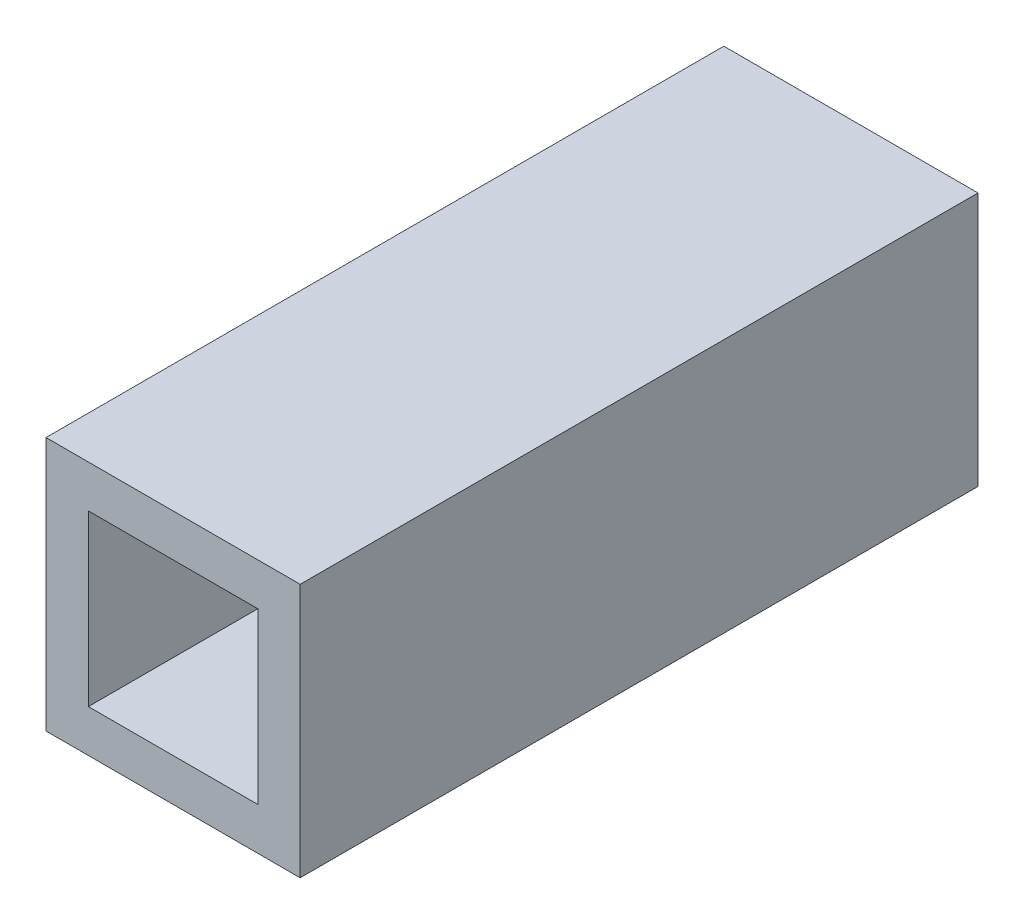
ISO-10303-21;
HEADER;
FILE_DESCRIPTION(('STEP AP214'),'2;1');
FILE_NAME('part.step','',(''),(''),'','','');
FILE_SCHEMA(('AUTOMOTIVE_DESIGN { 1 0 10303 214 1 1 1 1 }'));
ENDSEC;
DATA;
#1=APPLICATION_CONTEXT('core data for automotive mechanical design processes');
#2=APPLICATION_PROTOCOL_DEFINITION('international standard','automotive_design',2000,#1);
#3=PRODUCT_CONTEXT('',#1,'mechanical');
#4=PRODUCT('Part','Part','',(#3));
#5=PRODUCT_RELATED_PRODUCT_CATEGORY('part','',(#4));
#6=PRODUCT_DEFINITION_FORMATION('','',#4);
#7=PRODUCT_DEFINITION_CONTEXT('part definition',#1,'design');
#8=PRODUCT_DEFINITION('design','',#6,#7);
#9=PRODUCT_DEFINITION_SHAPE('','',#8);
#10=(LENGTH_UNIT() NAMED_UNIT(*) SI_UNIT(.MILLI.,.METRE.));
#11=(NAMED_UNIT(*) PLANE_ANGLE_UNIT() SI_UNIT($,.RADIAN.));
#12=(NAMED_UNIT(*) SI_UNIT($,.STERADIAN.) SOLID_ANGLE_UNIT());
#13=UNCERTAINTY_MEASURE_WITH_UNIT(LENGTH_MEASURE(1.E-05),#10,'distance_accuracy_value','');
#14=(GEOMETRIC_REPRESENTATION_CONTEXT(3) GLOBAL_UNCERTAINTY_ASSIGNED_CONTEXT((#13)) GLOBAL_UNIT_ASSIGNED_CONTEXT((#10,
#11,#12)) REPRESENTATION_CONTEXT('',''));
#15=CARTESIAN_POINT('',(0.,0.,0.));
#16=DIRECTION('',(0.,0.,1.));
#17=DIRECTION('',(1.,0.,0.));
#18=AXIS2_PLACEMENT_3D('',#15,#16,#17);
#19=CARTESIAN_POINT('',(9.52500000000001,-9.52499999999999,-50.8));
#20=DIRECTION('',(1.,0.,0.));
#21=DIRECTION('',(0.,0.,-1.));
#22=AXIS2_PLACEMENT_3D('',#19,#20,#21);
#23=PLANE('',#22);
#24=DIRECTION('',(0.,1.,0.));
#25=VECTOR('',#24,1.);
#26=CARTESIAN_POINT('',(9.52500000000001,-9.52499999999999,0.));
#27=LINE('',#26,#25);
#28=CARTESIAN_POINT('',(9.52500000000001,-9.52499999999999,0.));
#29=VERTEX_POINT('',#28);
#30=CARTESIAN_POINT('',(9.52500000000001,9.52500000000001,0.));
#31=VERTEX_POINT('',#30);
#32=EDGE_CURVE('E112',#29,#31,#27,.T.);
#33=ORIENTED_EDGE('',*,*,#32,.F.);
#34=DIRECTION('',(0.,0.,1.));
#35=VECTOR('',#34,1.);
#36=CARTESIAN_POINT('',(9.52500000000001,-9.52499999999999,-50.8));
#37=LINE('',#36,#35);
#38=CARTESIAN_POINT('',(9.52500000000001,-9.52499999999999,-50.8));
#39=VERTEX_POINT('',#38);
#40=EDGE_CURVE('E11',#39,#29,#37,.T.);
#41=ORIENTED_EDGE('',*,*,#40,.F.);
#42=DIRECTION('',(0.,1.,0.));
#43=VECTOR('',#42,1.);
#44=CARTESIAN_POINT('',(9.52500000000001,-9.52499999999999,-50.8));
#45=LINE('',#44,#43);
#46=CARTESIAN_POINT('',(9.52500000000001,9.52500000000001,-50.8));
#47=VERTEX_POINT('',#46);
#48=EDGE_CURVE('E151',#39,#47,#45,.T.);
#49=ORIENTED_EDGE('',*,*,#48,.T.);
#50=DIRECTION('',(0.,0.,1.));
#51=VECTOR('',#50,1.);
#52=CARTESIAN_POINT('',(9.52500000000001,9.52500000000001,-50.8));
#53=LINE('',#52,#51);
#54=EDGE_CURVE('E42',#47,#31,#53,.T.);
#55=ORIENTED_EDGE('',*,*,#54,.T.);
#56=EDGE_LOOP('',(#33,#41,#49,#55));
#57=FACE_BOUND('',#56,.T.);
#58=ADVANCED_FACE('F39',(#57),#23,.T.);
#59=CARTESIAN_POINT('',(-9.525,-9.52499999999999,-50.8));
#60=DIRECTION('',(0.,-1.,0.));
#61=DIRECTION('',(0.,0.,-1.));
#62=AXIS2_PLACEMENT_3D('',#59,#60,#61);
#63=PLANE('',#62);
#64=DIRECTION('',(1.,0.,0.));
#65=VECTOR('',#64,1.);
#66=CARTESIAN_POINT('',(-9.525,-9.52499999999999,0.));
#67=LINE('',#66,#65);
#68=CARTESIAN_POINT('',(-9.525,-9.52499999999999,0.));
#69=VERTEX_POINT('',#68);
#70=EDGE_CURVE('E156',#69,#29,#67,.T.);
#71=ORIENTED_EDGE('',*,*,#70,.F.);
#72=DIRECTION('',(0.,0.,1.));
#73=VECTOR('',#72,1.);
#74=CARTESIAN_POINT('',(-9.525,-9.52499999999999,-50.8));
#75=LINE('',#74,#73);
#76=CARTESIAN_POINT('',(-9.525,-9.52499999999999,-50.8));
#77=VERTEX_POINT('',#76);
#78=EDGE_CURVE('E48',#77,#69,#75,.T.);
#79=ORIENTED_EDGE('',*,*,#78,.F.);
#80=DIRECTION('',(1.,0.,0.));
#81=VECTOR('',#80,1.);
#82=CARTESIAN_POINT('',(-9.525,-9.52499999999999,-50.8));
#83=LINE('',#82,#81);
#84=EDGE_CURVE('E164',#77,#39,#83,.T.);
#85=ORIENTED_EDGE('',*,*,#84,.T.);
#86=ORIENTED_EDGE('',*,*,#40,.T.);
#87=EDGE_LOOP('',(#71,#79,#85,#86));
#88=FACE_BOUND('',#87,.T.);
#89=ADVANCED_FACE('F198',(#88),#63,.T.);
#90=CARTESIAN_POINT('',(-9.525,-9.52499999999999,-50.8));
#91=DIRECTION('',(-1.,0.,0.));
#92=DIRECTION('',(0.,0.,1.));
#93=AXIS2_PLACEMENT_3D('',#90,#91,#92);
#94=PLANE('',#93);
#95=DIRECTION('',(0.,-1.,0.));
#96=VECTOR('',#95,1.);
#97=CARTESIAN_POINT('',(-9.525,-9.52499999999999,0.));
#98=LINE('',#97,#96);
#99=CARTESIAN_POINT('',(-9.525,9.52500000000001,0.));
#100=VERTEX_POINT('',#99);
#101=EDGE_CURVE('E175',#100,#69,#98,.T.);
#102=ORIENTED_EDGE('',*,*,#101,.F.);
#103=DIRECTION('',(0.,0.,1.));
#104=VECTOR('',#103,1.);
#105=CARTESIAN_POINT('',(-9.525,9.52500000000001,-50.8));
#106=LINE('',#105,#104);
#107=CARTESIAN_POINT('',(-9.525,9.52500000000001,-50.8));
#108=VERTEX_POINT('',#107);
#109=EDGE_CURVE('E183',#108,#100,#106,.T.);
#110=ORIENTED_EDGE('',*,*,#109,.F.);
#111=DIRECTION('',(0.,-1.,0.));
#112=VECTOR('',#111,1.);
#113=CARTESIAN_POINT('',(-9.525,-9.52499999999999,-50.8));
#114=LINE('',#113,#112);
#115=EDGE_CURVE('E160',#108,#77,#114,.T.);
#116=ORIENTED_EDGE('',*,*,#115,.T.);
#117=ORIENTED_EDGE('',*,*,#78,.T.);
#118=EDGE_LOOP('',(#102,#110,#116,#117));
#119=FACE_BOUND('',#118,.T.);
#120=ADVANCED_FACE('F202',(#119),#94,.T.);
#121=CARTESIAN_POINT('',(-9.525,9.52500000000001,-50.8));
#122=DIRECTION('',(0.,1.,0.));
#123=DIRECTION('',(0.,0.,1.));
#124=AXIS2_PLACEMENT_3D('',#121,#122,#123);
#125=PLANE('',#124);
#126=DIRECTION('',(-1.,0.,0.));
#127=VECTOR('',#126,1.);
#128=CARTESIAN_POINT('',(-9.525,9.52500000000001,0.));
#129=LINE('',#128,#127);
#130=EDGE_CURVE('E171',#31,#100,#129,.T.);
#131=ORIENTED_EDGE('',*,*,#130,.F.);
#132=ORIENTED_EDGE('',*,*,#54,.F.);
#133=DIRECTION('',(-1.,0.,0.));
#134=VECTOR('',#133,1.);
#135=CARTESIAN_POINT('',(-9.525,9.52500000000001,-50.8));
#136=LINE('',#135,#134);
#137=EDGE_CURVE('E155',#47,#108,#136,.T.);
#138=ORIENTED_EDGE('',*,*,#137,.T.);
#139=ORIENTED_EDGE('',*,*,#109,.T.);
#140=EDGE_LOOP('',(#131,#132,#138,#139));
#141=FACE_BOUND('',#140,.T.);
#142=ADVANCED_FACE('F193',(#141),#125,.T.);
#143=CARTESIAN_POINT('',(0.,0.,-50.8));
#144=DIRECTION('',(0.,0.,-1.));
#145=DIRECTION('',(-1.,0.,0.));
#146=AXIS2_PLACEMENT_3D('',#143,#144,#145);
#147=PLANE('',#146);
#148=DIRECTION('',(0.,1.,0.));
#149=VECTOR('',#148,1.);
#150=CARTESIAN_POINT('',(6.35,-6.35,-50.8));
#151=LINE('',#150,#149);
#152=CARTESIAN_POINT('',(6.35,-6.35,-50.8));
#153=VERTEX_POINT('',#152);
#154=CARTESIAN_POINT('',(6.35,6.35,-50.8));
#155=VERTEX_POINT('',#154);
#156=EDGE_CURVE('E116',#153,#155,#151,.T.);
#157=ORIENTED_EDGE('',*,*,#156,.T.);
#158=DIRECTION('',(-1.,0.,0.));
#159=VECTOR('',#158,1.);
#160=CARTESIAN_POINT('',(-6.35,6.35,-50.8));
#161=LINE('',#160,#159);
#162=CARTESIAN_POINT('',(-6.35,6.35,-50.8));
#163=VERTEX_POINT('',#162);
#164=EDGE_CURVE('E104',#155,#163,#161,.T.);
#165=ORIENTED_EDGE('',*,*,#164,.T.);
#166=DIRECTION('',(0.,-1.,0.));
#167=VECTOR('',#166,1.);
#168=CARTESIAN_POINT('',(-6.35,-6.35,-50.8));
#169=LINE('',#168,#167);
#170=CARTESIAN_POINT('',(-6.35,-6.35,-50.8));
#171=VERTEX_POINT('',#170);
#172=EDGE_CURVE('E131',#163,#171,#169,.T.);
#173=ORIENTED_EDGE('',*,*,#172,.T.);
#174=DIRECTION('',(1.,0.,0.));
#175=VECTOR('',#174,1.);
#176=CARTESIAN_POINT('',(-6.35,-6.35,-50.8));
#177=LINE('',#176,#175);
#178=EDGE_CURVE('E124',#171,#153,#177,.T.);
#179=ORIENTED_EDGE('',*,*,#178,.T.);
#180=EDGE_LOOP('',(#157,#165,#173,#179));
#181=FACE_BOUND('',#180,.T.);
#182=ORIENTED_EDGE('',*,*,#48,.F.);
#183=ORIENTED_EDGE('',*,*,#84,.F.);
#184=ORIENTED_EDGE('',*,*,#115,.F.);
#185=ORIENTED_EDGE('',*,*,#137,.F.);
#186=EDGE_LOOP('',(#182,#183,#184,#185));
#187=FACE_BOUND('',#186,.T.);
#188=ADVANCED_FACE('F122',(#181,#187),#147,.T.);
#189=CARTESIAN_POINT('',(0.,0.,0.));
#190=DIRECTION('',(0.,0.,-1.));
#191=DIRECTION('',(-1.,0.,0.));
#192=AXIS2_PLACEMENT_3D('',#189,#190,#191);
#193=PLANE('',#192);
#194=DIRECTION('',(-1.,0.,0.));
#195=VECTOR('',#194,1.);
#196=CARTESIAN_POINT('',(-6.35,6.35,0.));
#197=LINE('',#196,#195);
#198=CARTESIAN_POINT('',(6.35,6.35,0.));
#199=VERTEX_POINT('',#198);
#200=CARTESIAN_POINT('',(-6.35,6.35,0.));
#201=VERTEX_POINT('',#200);
#202=EDGE_CURVE('E129',#199,#201,#197,.T.);
#203=ORIENTED_EDGE('',*,*,#202,.F.);
#204=DIRECTION('',(0.,1.,0.));
#205=VECTOR('',#204,1.);
#206=CARTESIAN_POINT('',(6.35,-6.35,0.));
#207=LINE('',#206,#205);
#208=CARTESIAN_POINT('',(6.35,-6.35,0.));
#209=VERTEX_POINT('',#208);
#210=EDGE_CURVE('E64',#209,#199,#207,.T.);
#211=ORIENTED_EDGE('',*,*,#210,.F.);
#212=DIRECTION('',(1.,0.,0.));
#213=VECTOR('',#212,1.);
#214=CARTESIAN_POINT('',(-6.35,-6.35,0.));
#215=LINE('',#214,#213);
#216=CARTESIAN_POINT('',(-6.35,-6.35,0.));
#217=VERTEX_POINT('',#216);
#218=EDGE_CURVE('E119',#217,#209,#215,.T.);
#219=ORIENTED_EDGE('',*,*,#218,.F.);
#220=DIRECTION('',(0.,-1.,0.));
#221=VECTOR('',#220,1.);
#222=CARTESIAN_POINT('',(-6.35,-6.35,0.));
#223=LINE('',#222,#221);
#224=EDGE_CURVE('E137',#201,#217,#223,.T.);
#225=ORIENTED_EDGE('',*,*,#224,.F.);
#226=EDGE_LOOP('',(#203,#211,#219,#225));
#227=FACE_BOUND('',#226,.T.);
#228=ORIENTED_EDGE('',*,*,#32,.T.);
#229=ORIENTED_EDGE('',*,*,#130,.T.);
#230=ORIENTED_EDGE('',*,*,#101,.T.);
#231=ORIENTED_EDGE('',*,*,#70,.T.);
#232=EDGE_LOOP('',(#228,#229,#230,#231));
#233=FACE_BOUND('',#232,.T.);
#234=ADVANCED_FACE('F195',(#227,#233),#193,.F.);
#235=CARTESIAN_POINT('',(6.35,-6.35,-50.801));
#236=DIRECTION('',(1.,0.,0.));
#237=DIRECTION('',(0.,0.,-1.));
#238=AXIS2_PLACEMENT_3D('',#235,#236,#237);
#239=PLANE('',#238);
#240=DIRECTION('',(0.,0.,1.));
#241=VECTOR('',#240,1.);
#242=CARTESIAN_POINT('',(6.35,-6.35,-50.801));
#243=LINE('',#242,#241);
#244=EDGE_CURVE('E113',#153,#209,#243,.T.);
#245=ORIENTED_EDGE('',*,*,#244,.T.);
#246=ORIENTED_EDGE('',*,*,#210,.T.);
#247=DIRECTION('',(0.,0.,1.));
#248=VECTOR('',#247,1.);
#249=CARTESIAN_POINT('',(6.35,6.35,-50.801));
#250=LINE('',#249,#248);
#251=EDGE_CURVE('E106',#155,#199,#250,.T.);
#252=ORIENTED_EDGE('',*,*,#251,.F.);
#253=ORIENTED_EDGE('',*,*,#156,.F.);
#254=EDGE_LOOP('',(#245,#246,#252,#253));
#255=FACE_BOUND('',#254,.T.);
#256=ADVANCED_FACE('F115',(#255),#239,.F.);
#257=CARTESIAN_POINT('',(-6.35,-6.35,-50.801));
#258=DIRECTION('',(0.,-1.,0.));
#259=DIRECTION('',(0.,0.,-1.));
#260=AXIS2_PLACEMENT_3D('',#257,#258,#259);
#261=PLANE('',#260);
#262=DIRECTION('',(0.,0.,1.));
#263=VECTOR('',#262,1.);
#264=CARTESIAN_POINT('',(-6.35,-6.35,-50.801));
#265=LINE('',#264,#263);
#266=EDGE_CURVE('E146',#171,#217,#265,.T.);
#267=ORIENTED_EDGE('',*,*,#266,.T.);
#268=ORIENTED_EDGE('',*,*,#218,.T.);
#269=ORIENTED_EDGE('',*,*,#244,.F.);
#270=ORIENTED_EDGE('',*,*,#178,.F.);
#271=EDGE_LOOP('',(#267,#268,#269,#270));
#272=FACE_BOUND('',#271,.T.);
#273=ADVANCED_FACE('F253',(#272),#261,.F.);
#274=CARTESIAN_POINT('',(-6.35,-6.35,-50.801));
#275=DIRECTION('',(-1.,0.,0.));
#276=DIRECTION('',(0.,0.,1.));
#277=AXIS2_PLACEMENT_3D('',#274,#275,#276);
#278=PLANE('',#277);
#279=DIRECTION('',(0.,0.,1.));
#280=VECTOR('',#279,1.);
#281=CARTESIAN_POINT('',(-6.35,6.35,-50.801));
#282=LINE('',#281,#280);
#283=EDGE_CURVE('E56',#163,#201,#282,.T.);
#284=ORIENTED_EDGE('',*,*,#283,.T.);
#285=ORIENTED_EDGE('',*,*,#224,.T.);
#286=ORIENTED_EDGE('',*,*,#266,.F.);
#287=ORIENTED_EDGE('',*,*,#172,.F.);
#288=EDGE_LOOP('',(#284,#285,#286,#287));
#289=FACE_BOUND('',#288,.T.);
#290=ADVANCED_FACE('F262',(#289),#278,.F.);
#291=CARTESIAN_POINT('',(-6.35,6.35,-50.801));
#292=DIRECTION('',(0.,1.,0.));
#293=DIRECTION('',(0.,0.,1.));
#294=AXIS2_PLACEMENT_3D('',#291,#292,#293);
#295=PLANE('',#294);
#296=ORIENTED_EDGE('',*,*,#251,.T.);
#297=ORIENTED_EDGE('',*,*,#202,.T.);
#298=ORIENTED_EDGE('',*,*,#283,.F.);
#299=ORIENTED_EDGE('',*,*,#164,.F.);
#300=EDGE_LOOP('',(#296,#297,#298,#299));
#301=FACE_BOUND('',#300,.T.);
#302=ADVANCED_FACE('F105',(#301),#295,.F.);
#303=CLOSED_SHELL('',(#58,#89,#120,#142,#188,#234,#256,#273,#290,#302));
#304=MANIFOLD_SOLID_BREP('B2',#303);
#305=ADVANCED_BREP_SHAPE_REPRESENTATION('',(#18,#304),#14);
#306=SHAPE_DEFINITION_REPRESENTATION(#9,#305);
ENDSEC;
END-ISO-10303-21;
